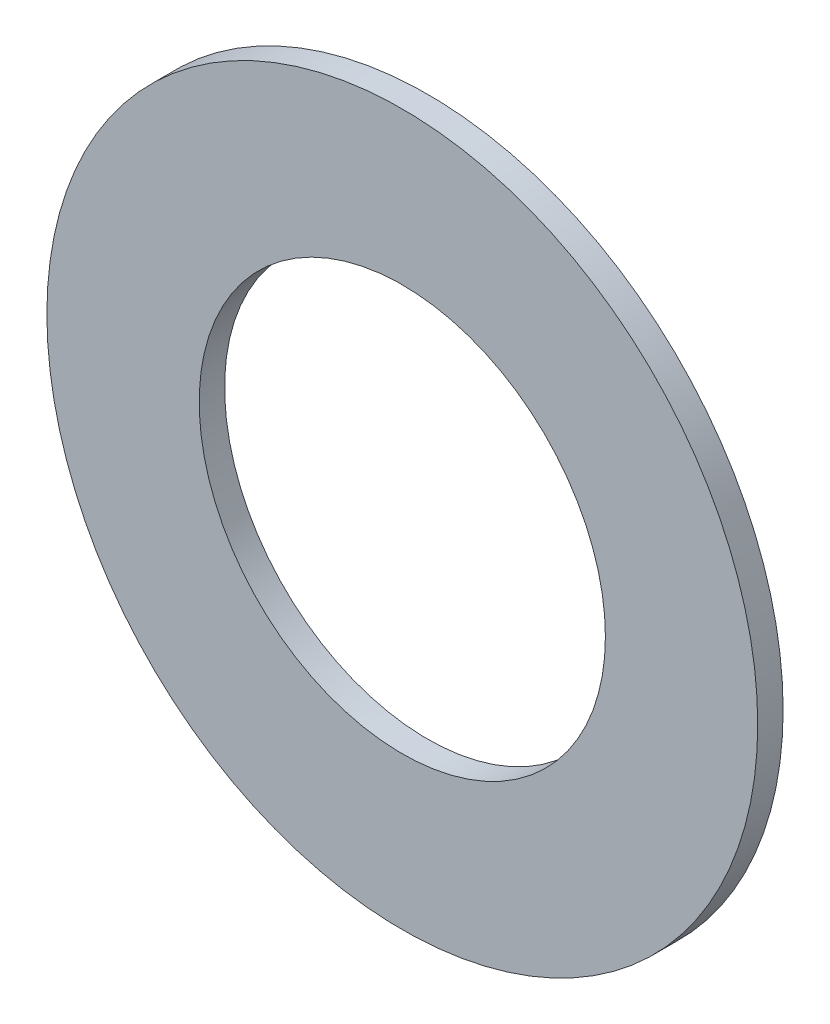
ISO-10303-21;
HEADER;
FILE_DESCRIPTION(('STEP AP214'),'2;1');
FILE_NAME('part.step','',(''),(''),'','','');
FILE_SCHEMA(('AUTOMOTIVE_DESIGN { 1 0 10303 214 1 1 1 1 }'));
ENDSEC;
DATA;
#1=APPLICATION_CONTEXT('core data for automotive mechanical design processes');
#2=APPLICATION_PROTOCOL_DEFINITION('international standard','automotive_design',2000,#1);
#3=PRODUCT_CONTEXT('',#1,'mechanical');
#4=PRODUCT('Part','Part','',(#3));
#5=PRODUCT_RELATED_PRODUCT_CATEGORY('part','',(#4));
#6=PRODUCT_DEFINITION_FORMATION('','',#4);
#7=PRODUCT_DEFINITION_CONTEXT('part definition',#1,'design');
#8=PRODUCT_DEFINITION('design','',#6,#7);
#9=PRODUCT_DEFINITION_SHAPE('','',#8);
#10=(LENGTH_UNIT() NAMED_UNIT(*) SI_UNIT(.MILLI.,.METRE.));
#11=(NAMED_UNIT(*) PLANE_ANGLE_UNIT() SI_UNIT($,.RADIAN.));
#12=(NAMED_UNIT(*) SI_UNIT($,.STERADIAN.) SOLID_ANGLE_UNIT());
#13=UNCERTAINTY_MEASURE_WITH_UNIT(LENGTH_MEASURE(1.E-05),#10,'distance_accuracy_value','');
#14=(GEOMETRIC_REPRESENTATION_CONTEXT(3) GLOBAL_UNCERTAINTY_ASSIGNED_CONTEXT((#13)) GLOBAL_UNIT_ASSIGNED_CONTEXT((#10,
#11,#12)) REPRESENTATION_CONTEXT('',''));
#15=CARTESIAN_POINT('',(0.,0.,0.));
#16=DIRECTION('',(0.,0.,1.));
#17=DIRECTION('',(1.,0.,0.));
#18=AXIS2_PLACEMENT_3D('',#15,#16,#17);
#19=CARTESIAN_POINT('',(0.,0.,0.5));
#20=DIRECTION('',(0.,0.,1.));
#21=DIRECTION('',(1.,0.,0.));
#22=AXIS2_PLACEMENT_3D('',#19,#20,#21);
#23=PLANE('',#22);
#24=CARTESIAN_POINT('',(0.,0.,0.5));
#25=DIRECTION('',(0.,0.,1.));
#26=DIRECTION('',(1.,0.,0.));
#27=AXIS2_PLACEMENT_3D('',#24,#25,#26);
#28=CIRCLE('',#27,7.);
#29=CARTESIAN_POINT('',(7.,0.,0.5));
#30=VERTEX_POINT('',#29);
#31=EDGE_CURVE('E10',#30,#30,#28,.T.);
#32=ORIENTED_EDGE('',*,*,#31,.T.);
#33=EDGE_LOOP('',(#32));
#34=FACE_BOUND('',#33,.T.);
#35=CARTESIAN_POINT('',(0.,0.,0.5));
#36=DIRECTION('',(0.,0.,1.));
#37=DIRECTION('',(1.,0.,0.));
#38=AXIS2_PLACEMENT_3D('',#35,#36,#37);
#39=CIRCLE('',#38,4.);
#40=CARTESIAN_POINT('',(4.,0.,0.5));
#41=VERTEX_POINT('',#40);
#42=EDGE_CURVE('E42',#41,#41,#39,.T.);
#43=ORIENTED_EDGE('',*,*,#42,.F.);
#44=EDGE_LOOP('',(#43));
#45=FACE_BOUND('',#44,.T.);
#46=ADVANCED_FACE('F31',(#34,#45),#23,.T.);
#47=CARTESIAN_POINT('',(0.,0.,0.));
#48=DIRECTION('',(0.,0.,1.));
#49=DIRECTION('',(1.,0.,0.));
#50=AXIS2_PLACEMENT_3D('',#47,#48,#49);
#51=PLANE('',#50);
#52=CARTESIAN_POINT('',(0.,0.,0.));
#53=DIRECTION('',(0.,0.,1.));
#54=DIRECTION('',(1.,0.,0.));
#55=AXIS2_PLACEMENT_3D('',#52,#53,#54);
#56=CIRCLE('',#55,7.);
#57=CARTESIAN_POINT('',(7.,0.,0.));
#58=VERTEX_POINT('',#57);
#59=EDGE_CURVE('E35',#58,#58,#56,.T.);
#60=ORIENTED_EDGE('',*,*,#59,.F.);
#61=EDGE_LOOP('',(#60));
#62=FACE_BOUND('',#61,.T.);
#63=CARTESIAN_POINT('',(0.,0.,0.));
#64=DIRECTION('',(0.,0.,1.));
#65=DIRECTION('',(1.,0.,0.));
#66=AXIS2_PLACEMENT_3D('',#63,#64,#65);
#67=CIRCLE('',#66,4.);
#68=CARTESIAN_POINT('',(4.,0.,0.));
#69=VERTEX_POINT('',#68);
#70=EDGE_CURVE('E44',#69,#69,#67,.T.);
#71=ORIENTED_EDGE('',*,*,#70,.T.);
#72=EDGE_LOOP('',(#71));
#73=FACE_BOUND('',#72,.T.);
#74=ADVANCED_FACE('F54',(#62,#73),#51,.F.);
#75=CARTESIAN_POINT('',(0.,0.,0.5));
#76=DIRECTION('',(0.,0.,-1.));
#77=DIRECTION('',(-1.,0.,0.));
#78=AXIS2_PLACEMENT_3D('',#75,#76,#77);
#79=CYLINDRICAL_SURFACE('',#78,7.);
#80=ORIENTED_EDGE('',*,*,#31,.F.);
#81=EDGE_LOOP('',(#80));
#82=FACE_BOUND('',#81,.T.);
#83=ORIENTED_EDGE('',*,*,#59,.T.);
#84=EDGE_LOOP('',(#83));
#85=FACE_BOUND('',#84,.T.);
#86=ADVANCED_FACE('F33',(#82,#85),#79,.T.);
#87=CARTESIAN_POINT('',(0.,0.,0.5));
#88=DIRECTION('',(0.,0.,-1.));
#89=DIRECTION('',(-1.,0.,0.));
#90=AXIS2_PLACEMENT_3D('',#87,#88,#89);
#91=CYLINDRICAL_SURFACE('',#90,4.);
#92=ORIENTED_EDGE('',*,*,#42,.T.);
#93=EDGE_LOOP('',(#92));
#94=FACE_BOUND('',#93,.T.);
#95=ORIENTED_EDGE('',*,*,#70,.F.);
#96=EDGE_LOOP('',(#95));
#97=FACE_BOUND('',#96,.T.);
#98=ADVANCED_FACE('F50',(#94,#97),#91,.F.);
#99=CLOSED_SHELL('',(#46,#74,#86,#98));
#100=MANIFOLD_SOLID_BREP('B2',#99);
#101=ADVANCED_BREP_SHAPE_REPRESENTATION('',(#18,#100),#14);
#102=SHAPE_DEFINITION_REPRESENTATION(#9,#101);
ENDSEC;
END-ISO-10303-21;
